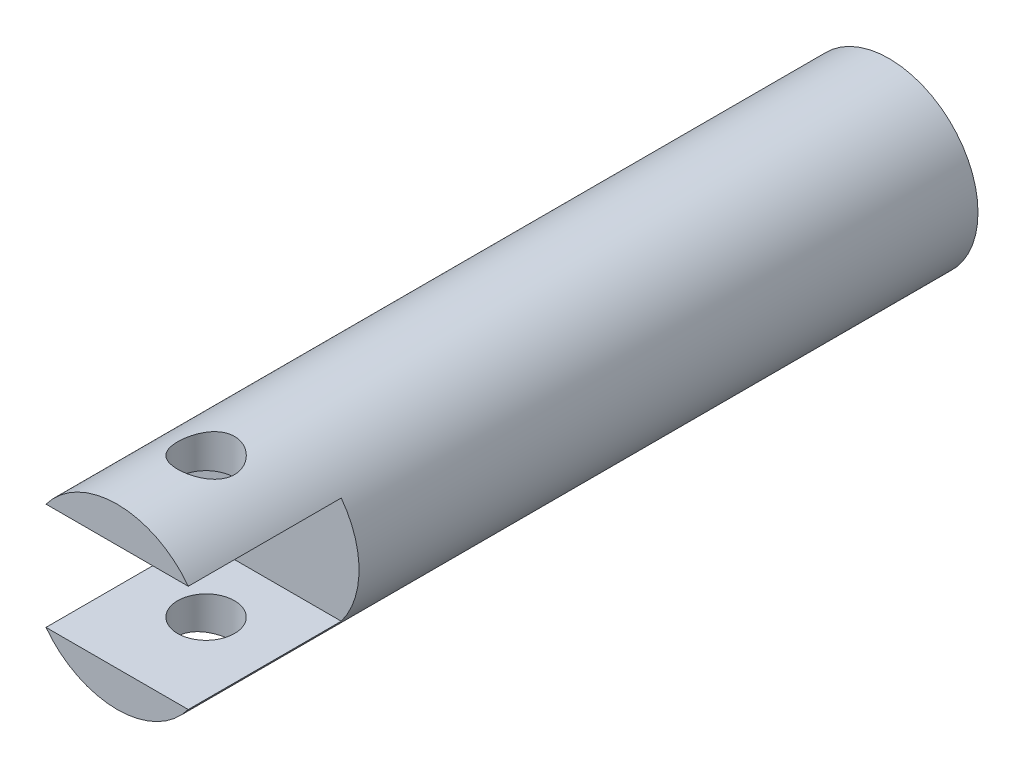
ISO-10303-21;
HEADER;
FILE_DESCRIPTION(('STEP AP214'),'2;1');
FILE_NAME('part.step','',(''),(''),'','','');
FILE_SCHEMA(('AUTOMOTIVE_DESIGN { 1 0 10303 214 1 1 1 1 }'));
ENDSEC;
DATA;
#1=APPLICATION_CONTEXT('core data for automotive mechanical design processes');
#2=APPLICATION_PROTOCOL_DEFINITION('international standard','automotive_design',2000,#1);
#3=PRODUCT_CONTEXT('',#1,'mechanical');
#4=PRODUCT('Part','Part','',(#3));
#5=PRODUCT_RELATED_PRODUCT_CATEGORY('part','',(#4));
#6=PRODUCT_DEFINITION_FORMATION('','',#4);
#7=PRODUCT_DEFINITION_CONTEXT('part definition',#1,'design');
#8=PRODUCT_DEFINITION('design','',#6,#7);
#9=PRODUCT_DEFINITION_SHAPE('','',#8);
#10=(LENGTH_UNIT() NAMED_UNIT(*) SI_UNIT(.MILLI.,.METRE.));
#11=(NAMED_UNIT(*) PLANE_ANGLE_UNIT() SI_UNIT($,.RADIAN.));
#12=(NAMED_UNIT(*) SI_UNIT($,.STERADIAN.) SOLID_ANGLE_UNIT());
#13=UNCERTAINTY_MEASURE_WITH_UNIT(LENGTH_MEASURE(1.E-05),#10,'distance_accuracy_value','');
#14=(GEOMETRIC_REPRESENTATION_CONTEXT(3) GLOBAL_UNCERTAINTY_ASSIGNED_CONTEXT((#13)) GLOBAL_UNIT_ASSIGNED_CONTEXT((#10,
#11,#12)) REPRESENTATION_CONTEXT('',''));
#15=CARTESIAN_POINT('',(0.,0.,0.));
#16=DIRECTION('',(0.,0.,1.));
#17=DIRECTION('',(1.,0.,0.));
#18=AXIS2_PLACEMENT_3D('',#15,#16,#17);
#19=CARTESIAN_POINT('',(0.,0.,217.));
#20=DIRECTION('',(0.,0.,1.));
#21=DIRECTION('',(1.,0.,0.));
#22=AXIS2_PLACEMENT_3D('',#19,#20,#21);
#23=PLANE('',#22);
#24=DIRECTION('',(-1.,0.,0.));
#25=VECTOR('',#24,1.);
#26=CARTESIAN_POINT('',(0.,15.,217.));
#27=LINE('',#26,#25);
#28=CARTESIAN_POINT('',(20.,15.,217.));
#29=VERTEX_POINT('',#28);
#30=CARTESIAN_POINT('',(-20.,15.,217.));
#31=VERTEX_POINT('',#30);
#32=EDGE_CURVE('E126',#29,#31,#27,.T.);
#33=ORIENTED_EDGE('',*,*,#32,.F.);
#34=CARTESIAN_POINT('',(0.,0.,217.));
#35=DIRECTION('',(0.,0.,1.));
#36=DIRECTION('',(1.,0.,0.));
#37=AXIS2_PLACEMENT_3D('',#34,#35,#36);
#38=CIRCLE('',#37,25.);
#39=EDGE_CURVE('E121',#29,#31,#38,.T.);
#40=ORIENTED_EDGE('',*,*,#39,.T.);
#41=EDGE_LOOP('',(#33,#40));
#42=FACE_BOUND('',#41,.T.);
#43=ADVANCED_FACE('F43',(#42),#23,.T.);
#44=CARTESIAN_POINT('',(0.,0.,217.));
#45=DIRECTION('',(0.,0.,-1.));
#46=DIRECTION('',(-1.,0.,0.));
#47=AXIS2_PLACEMENT_3D('',#44,#45,#46);
#48=CYLINDRICAL_SURFACE('',#47,25.);
#49=CARTESIAN_POINT('',(0.,-25.,200.));
#50=CARTESIAN_POINT('',(0.218743265247565,-24.9999999061477,199.999999862811));
#51=CARTESIAN_POINT('',(0.43748888425134,-24.9971224010622,199.991021108109));
#52=CARTESIAN_POINT('',(0.87336189831748,-24.985691347525,199.955190674816));
#53=CARTESIAN_POINT('',(1.09048927039918,-24.9771377186217,199.928338742897));
#54=CARTESIAN_POINT('',(1.52153070666351,-24.9545891858396,199.857013696657));
#55=CARTESIAN_POINT('',(1.73544490489068,-24.9405945096043,199.812541319544));
#56=CARTESIAN_POINT('',(2.15863313908122,-24.9075364102002,199.706355425903));
#57=CARTESIAN_POINT('',(2.36790535620395,-24.888471036932,199.644635275727));
#58=CARTESIAN_POINT('',(2.77988031823148,-24.8458260104941,199.504632126803));
#59=CARTESIAN_POINT('',(2.98259542357033,-24.8222555090754,199.426382672481));
#60=CARTESIAN_POINT('',(3.38065275599839,-24.7711822888404,199.253844594609));
#61=CARTESIAN_POINT('',(3.57599217498418,-24.7436780910757,199.159549936016));
#62=CARTESIAN_POINT('',(3.95794908794833,-24.6854603705866,198.955680457104));
#63=CARTESIAN_POINT('',(4.14456903959479,-24.6547477601795,198.846109977539));
#64=CARTESIAN_POINT('',(4.50811504509704,-24.5908719246595,198.612383925673));
#65=CARTESIAN_POINT('',(4.68503659666326,-24.5577075778769,198.488221662117));
#66=CARTESIAN_POINT('',(5.03301408453022,-24.488796033414,198.222385309282));
#67=CARTESIAN_POINT('',(5.20375408879706,-24.4530019467294,198.080309699126));
#68=CARTESIAN_POINT('',(5.53275380725715,-24.3806687959203,197.782548227954));
#69=CARTESIAN_POINT('',(5.69101326907349,-24.3441297167497,197.626862091845));
#70=CARTESIAN_POINT('',(5.99413557676902,-24.2712721273087,197.302790073572));
#71=CARTESIAN_POINT('',(6.13899335443544,-24.2349537052978,197.134399430205));
#72=CARTESIAN_POINT('',(6.41427135840069,-24.1635539684896,196.786061499396));
#73=CARTESIAN_POINT('',(6.54469691314274,-24.1284722003959,196.606118516167));
#74=CARTESIAN_POINT('',(6.79356627376886,-24.0596046131892,196.230779688898));
#75=CARTESIAN_POINT('',(6.91159914571261,-24.0258780779972,196.03510013926));
#76=CARTESIAN_POINT('',(7.13064926390916,-23.9617792893349,195.634010605258));
#77=CARTESIAN_POINT('',(7.23167321503684,-23.9314057157688,195.428604496184));
#78=CARTESIAN_POINT('',(7.41592928430639,-23.8749509852088,195.009387506085));
#79=CARTESIAN_POINT('',(7.4991615561078,-23.8488697911438,194.795576697666));
#80=CARTESIAN_POINT('',(7.64708668337306,-23.8018507099147,194.361085427054));
#81=CARTESIAN_POINT('',(7.71178030064701,-23.7809126114101,194.140405247558));
#82=CARTESIAN_POINT('',(7.82027654696603,-23.7454507385788,193.700852631298));
#83=CARTESIAN_POINT('',(7.8646711461595,-23.7307462657405,193.482140854624));
#84=CARTESIAN_POINT('',(7.93505826774671,-23.7073033405608,193.04145785506));
#85=CARTESIAN_POINT('',(7.96105114480748,-23.6985647732351,192.819486695075));
#86=CARTESIAN_POINT('',(7.99437065635129,-23.6873457397689,192.374043844835));
#87=CARTESIAN_POINT('',(8.00170182918087,-23.6848637520901,192.15057253266));
#88=CARTESIAN_POINT('',(7.99763563591977,-23.6862371500807,191.703822941352));
#89=CARTESIAN_POINT('',(7.98623874529432,-23.690092374862,191.480544657463));
#90=CARTESIAN_POINT('',(7.94570429414829,-23.703717269299,191.045251107606));
#91=CARTESIAN_POINT('',(7.91733072305876,-23.7132321396269,190.833156168725));
#92=CARTESIAN_POINT('',(7.84374939322094,-23.7376725259022,190.412147192187));
#93=CARTESIAN_POINT('',(7.79853566669937,-23.7525999598911,190.20323430953));
#94=CARTESIAN_POINT('',(7.69168696924465,-23.7874147928651,189.790145831872));
#95=CARTESIAN_POINT('',(7.63005683359995,-23.8073007312625,189.585968861174));
#96=CARTESIAN_POINT('',(7.49085223656067,-23.8514666562278,189.183533179719));
#97=CARTESIAN_POINT('',(7.41327173347221,-23.8757483073899,188.985276744232));
#98=CARTESIAN_POINT('',(7.24151771277466,-23.9284057786095,188.593106936181));
#99=CARTESIAN_POINT('',(7.14711609407101,-23.9568367598391,188.39930092285));
#100=CARTESIAN_POINT('',(6.94318205382553,-24.016734069374,188.020230878507));
#101=CARTESIAN_POINT('',(6.83364445495079,-24.0482014351731,187.834969799373));
#102=CARTESIAN_POINT('',(6.60020078291722,-24.1133164203647,187.474126788125));
#103=CARTESIAN_POINT('',(6.47629393858844,-24.1469641567308,187.298545376245));
#104=CARTESIAN_POINT('',(6.21490027829254,-24.2155584134681,186.958067669023));
#105=CARTESIAN_POINT('',(6.07741302148026,-24.2505049759786,186.793171720838));
#106=CARTESIAN_POINT('',(5.78275806425719,-24.3224956711356,186.467347476148));
#107=CARTESIAN_POINT('',(5.62496187025065,-24.3595598527758,186.306991393903));
#108=CARTESIAN_POINT('',(5.29641148883156,-24.433099471755,186.000121710398));
#109=CARTESIAN_POINT('',(5.12566144275532,-24.4695750927716,185.853603718461));
#110=CARTESIAN_POINT('',(4.77213983863551,-24.5409699950185,185.575257518353));
#111=CARTESIAN_POINT('',(4.58936277455008,-24.575888550969,185.443436113827));
#112=CARTESIAN_POINT('',(4.21308321485073,-24.6431823932812,185.195540549152));
#113=CARTESIAN_POINT('',(4.01958499097012,-24.6755586803299,185.079460179809));
#114=CARTESIAN_POINT('',(3.62126665237256,-24.7371662926383,184.86289456203));
#115=CARTESIAN_POINT('',(3.41636056460431,-24.7663668098111,184.762558507381));
#116=CARTESIAN_POINT('',(2.99832036669395,-24.8204446279348,184.579615304564));
#117=CARTESIAN_POINT('',(2.7851894593964,-24.8453235913977,184.497001335781));
#118=CARTESIAN_POINT('',(2.35217103924883,-24.8900514164328,184.35019274876));
#119=CARTESIAN_POINT('',(2.13228393720663,-24.9099005831638,184.285997013054));
#120=CARTESIAN_POINT('',(1.68740364417465,-24.9439857927418,184.176629116786));
#121=CARTESIAN_POINT('',(1.46241066837477,-24.9582220716843,184.131456156063));
#122=CARTESIAN_POINT('',(1.0182286451773,-24.9802051338952,184.062009945985));
#123=CARTESIAN_POINT('',(0.799171422951561,-24.9881904590846,184.036967363048));
#124=CARTESIAN_POINT('',(0.359605520473407,-24.998380097374,184.005049180525));
#125=CARTESIAN_POINT('',(0.139096881477423,-25.0005845740889,183.998173066775));
#126=CARTESIAN_POINT('',(-0.301684388611459,-24.9991510782414,184.002653038831));
#127=CARTESIAN_POINT('',(-0.521957047982127,-24.99551390883,184.014006618289));
#128=CARTESIAN_POINT('',(-0.960643471861166,-24.9825002143682,184.054832228217));
#129=CARTESIAN_POINT('',(-1.17905725268574,-24.9731237397469,184.084304099489));
#130=CARTESIAN_POINT('',(-1.60666085758015,-24.9492140183119,184.160068066689));
#131=CARTESIAN_POINT('',(-1.81594168521826,-24.934824131048,184.205893338395));
#132=CARTESIAN_POINT('',(-2.22986305734507,-24.9012216991691,184.31407229503));
#133=CARTESIAN_POINT('',(-2.4345020278266,-24.8820075445802,184.37643149812));
#134=CARTESIAN_POINT('',(-2.83767351616123,-24.8392571724058,184.517140564167));
#135=CARTESIAN_POINT('',(-3.03620765701015,-24.8157221153545,184.595486134036));
#136=CARTESIAN_POINT('',(-3.4260590530831,-24.7649102825711,184.767604732679));
#137=CARTESIAN_POINT('',(-3.61737354934722,-24.737632094513,184.861383587283));
#138=CARTESIAN_POINT('',(-3.99619379672531,-24.6793044180003,185.06617455213));
#139=CARTESIAN_POINT('',(-4.18348835944252,-24.6481783487328,185.177555483783));
#140=CARTESIAN_POINT('',(-4.54814586170992,-24.5835041721626,185.415037465053));
#141=CARTESIAN_POINT('',(-4.72550534170239,-24.5499552303715,185.541143595653));
#142=CARTESIAN_POINT('',(-5.06919619917251,-24.4812982895492,185.80722323996));
#143=CARTESIAN_POINT('',(-5.23552671030185,-24.446190168402,185.947197840915));
#144=CARTESIAN_POINT('',(-5.55617802638372,-24.3753123574237,186.240134853335));
#145=CARTESIAN_POINT('',(-5.71049855184838,-24.3395426522205,186.393097566878));
#146=CARTESIAN_POINT('',(-6.01242126512027,-24.266765496975,186.71776869709));
#147=CARTESIAN_POINT('',(-6.15947074535409,-24.2297690083856,186.889994101045));
#148=CARTESIAN_POINT('',(-6.43851923775675,-24.1571160782401,187.246403697399));
#149=CARTESIAN_POINT('',(-6.570523270124,-24.1214591923783,187.43058386848));
#150=CARTESIAN_POINT('',(-6.81866458072102,-24.0524927808986,187.809869984534));
#151=CARTESIAN_POINT('',(-6.93479547633882,-24.0191842021299,188.004980280327));
#152=CARTESIAN_POINT('',(-7.15020596800438,-23.9559420021258,188.404714434404));
#153=CARTESIAN_POINT('',(-7.24949254862722,-23.9260069837647,188.609334304437));
#154=CARTESIAN_POINT('',(-7.43020088832158,-23.870505447889,189.026186059536));
#155=CARTESIAN_POINT('',(-7.51167310646886,-23.8449266381716,189.23839441022));
#156=CARTESIAN_POINT('',(-7.65636529827826,-23.7988621590757,189.669394776871));
#157=CARTESIAN_POINT('',(-7.71959257425074,-23.7783744525038,189.888184120054));
#158=CARTESIAN_POINT('',(-7.82723033979725,-23.7431606371553,190.330771410414));
#159=CARTESIAN_POINT('',(-7.87164342134527,-23.7284337347517,190.554568663192));
#160=CARTESIAN_POINT('',(-7.94121566442474,-23.7052408808499,191.005454383198));
#161=CARTESIAN_POINT('',(-7.96637569553841,-23.6967746465831,191.232542701309));
#162=CARTESIAN_POINT('',(-7.99645049180489,-23.6866420864421,191.677366942456));
#163=CARTESIAN_POINT('',(-8.00226930238732,-23.6846721480483,191.895035308855));
#164=CARTESIAN_POINT('',(-7.99614679514984,-23.6867399313,192.330092144339));
#165=CARTESIAN_POINT('',(-7.98420580907816,-23.6907775407262,192.547480618577));
#166=CARTESIAN_POINT('',(-7.94268054634167,-23.7047316455029,192.980358057932));
#167=CARTESIAN_POINT('',(-7.91309736864516,-23.7146477746682,193.195847140517));
#168=CARTESIAN_POINT('',(-7.83656732967567,-23.7400470604446,193.623383586202));
#169=CARTESIAN_POINT('',(-7.78962040030635,-23.7555302388885,193.8354309358));
#170=CARTESIAN_POINT('',(-7.67969358667198,-23.7912922196723,194.251173669937));
#171=CARTESIAN_POINT('',(-7.6169882699802,-23.8114885111398,194.454948914285));
#172=CARTESIAN_POINT('',(-7.47567925141455,-23.8562299898703,194.856490353429));
#173=CARTESIAN_POINT('',(-7.39707024932656,-23.8807766266318,195.054254519576));
#174=CARTESIAN_POINT('',(-7.22458410698328,-23.933522740927,195.442454176872));
#175=CARTESIAN_POINT('',(-7.13070967680561,-23.961721569905,195.632890961447));
#176=CARTESIAN_POINT('',(-6.92831365997187,-24.0210238998718,196.005424482674));
#177=CARTESIAN_POINT('',(-6.81978682069163,-24.0521284412685,196.187518196986));
#178=CARTESIAN_POINT('',(-6.5841334208022,-24.1177267113063,196.549471891376));
#179=CARTESIAN_POINT('',(-6.45643079187723,-24.1523067527788,196.728941354494));
#180=CARTESIAN_POINT('',(-6.18680926743206,-24.2227744441253,197.076591818307));
#181=CARTESIAN_POINT('',(-6.0448899286005,-24.2586621347526,197.244772466717));
#182=CARTESIAN_POINT('',(-5.74766448038851,-24.3307982502988,197.568906857108));
#183=CARTESIAN_POINT('',(-5.59235279583197,-24.3670468198413,197.724855454846));
#184=CARTESIAN_POINT('',(-5.26938993453569,-24.4389215125895,198.023444203562));
#185=CARTESIAN_POINT('',(-5.10174285792802,-24.4745478377931,198.166088741217));
#186=CARTESIAN_POINT('',(-4.74894112096544,-24.5454895286252,198.442007274254));
#187=CARTESIAN_POINT('',(-4.56337747943052,-24.5807495900706,198.574773197678));
#188=CARTESIAN_POINT('',(-4.18131157536835,-24.6486157658354,198.824122777065));
#189=CARTESIAN_POINT('',(-3.98481320350348,-24.6812228140783,198.940712137845));
#190=CARTESIAN_POINT('',(-3.58214010374017,-24.7428727035054,199.15684856076));
#191=CARTESIAN_POINT('',(-3.37596625600627,-24.7719158680257,199.256397169255));
#192=CARTESIAN_POINT('',(-2.95536223754053,-24.8256070490431,199.437624727694));
#193=CARTESIAN_POINT('',(-2.74093265081571,-24.8502553757369,199.519304938918));
#194=CARTESIAN_POINT('',(-2.32073755029346,-24.8928821566616,199.658960960613));
#195=CARTESIAN_POINT('',(-2.11542697677707,-24.9112083268921,199.718201953922));
#196=CARTESIAN_POINT('',(-1.70037248611578,-24.942975795015,199.820127250336));
#197=CARTESIAN_POINT('',(-1.49062887681958,-24.9564174309383,199.862812699171));
#198=CARTESIAN_POINT('',(-1.06816763558635,-24.9780652480482,199.931254554404));
#199=CARTESIAN_POINT('',(-0.855450551847945,-24.9862723816063,199.957014040358));
#200=CARTESIAN_POINT('',(-0.428489757171346,-24.9972398727651,199.991387048243));
#201=CARTESIAN_POINT('',(-0.214246007569128,-25.0000000919227,200.000000134369));
#202=CARTESIAN_POINT('',(0.,-25.,200.));
#203=B_SPLINE_CURVE_WITH_KNOTS('',3,(#49,#50,#51,#52,#53,#54,#55,#56,#57,#58,#59,#60,#61,#62,
#63,#64,#65,#66,#67,#68,#69,#70,#71,#72,#73,#74,#75,#76,#77,#78,#79,#80,#81,#82,#83,#84,#85,#86,
#87,#88,#89,#90,#91,#92,#93,#94,#95,#96,#97,#98,#99,#100,#101,#102,#103,#104,#105,#106,#107,
#108,#109,#110,#111,#112,#113,#114,#115,#116,#117,#118,#119,#120,#121,#122,#123,#124,#125,#126,
#127,#128,#129,#130,#131,#132,#133,#134,#135,#136,#137,#138,#139,#140,#141,#142,#143,#144,#145,
#146,#147,#148,#149,#150,#151,#152,#153,#154,#155,#156,#157,#158,#159,#160,#161,#162,#163,#164,
#165,#166,#167,#168,#169,#170,#171,#172,#173,#174,#175,#176,#177,#178,#179,#180,#181,#182,#183,
#184,#185,#186,#187,#188,#189,#190,#191,#192,#193,#194,#195,#196,#197,#198,#199,#200,#201,#202),
.UNSPECIFIED.,.T.,.F.,(4,2,2,2,2,2,2,2,2,2,2,2,2,2,2,2,2,2,2,2,2,2,2,2,2,2,2,2,2,2,2,2,2,2,2,2,
2,2,2,2,2,2,2,2,2,2,2,2,2,2,2,2,2,2,2,2,2,2,2,2,2,2,2,2,2,2,2,2,2,2,2,2,2,2,2,2,4),(0.,
0.656031665610723,1.3120726298196,1.96808614941623,2.62435232579349,3.27929926101466,
3.93449308656876,4.58950111124318,5.24481067914069,5.91900362945157,6.59321020954772,
7.26767072585324,7.9418813914792,8.63402376289964,9.32589265142225,10.0177555643119,
10.7095900423568,11.3797100261309,12.0498170939437,12.7197611826031,13.3896882630868,
14.0315222200871,14.673583845389,15.3154565665988,15.9575728663221,16.6091708298972,
17.2609922298908,17.9128486280966,18.5647261937175,19.2479546420813,19.9309655759316,
20.6142914015881,21.2973468942376,21.9865280662665,22.6754435186197,23.3643171643094,
24.0531618307572,24.7142284876896,25.375276434299,26.0362335031196,26.6971847644316,
27.3406067356917,27.9842437183902,28.6277080813896,29.2714159018675,29.9310423920676,
30.5908971650853,31.2508037098049,31.9107256068116,32.5983077197442,33.2856597320606,
33.9732873216336,34.6606290825568,35.3459979798137,36.0310921850403,36.7160919762155,
37.4010608269017,38.0535257793628,38.7059785441072,39.3583906704754,40.0108053554696,
40.6525575617292,41.2945239978234,41.9363765895295,42.5784598877874,43.2465993670095,
43.9147596869244,44.5831995145326,45.2514181560312,45.9432092356098,46.6347557250828,
47.3262394270222,48.0176743032877,48.660363380784,49.303007972936,49.9455356082041,
50.5880795742409),.UNSPECIFIED.);
#204=CARTESIAN_POINT('',(0.,-25.,200.));
#205=VERTEX_POINT('',#204);
#206=EDGE_CURVE('E93',#205,#205,#203,.T.);
#207=ORIENTED_EDGE('',*,*,#206,.T.);
#208=EDGE_LOOP('',(#207));
#209=FACE_BOUND('',#208,.T.);
#210=CARTESIAN_POINT('',(0.,25.,200.));
#211=CARTESIAN_POINT('',(-0.218743265247565,24.9999999061477,199.999999862811));
#212=CARTESIAN_POINT('',(-0.43748888425134,24.9971224010622,199.991021108109));
#213=CARTESIAN_POINT('',(-0.87336189831748,24.985691347525,199.955190674816));
#214=CARTESIAN_POINT('',(-1.09048927039918,24.9771377186217,199.928338742897));
#215=CARTESIAN_POINT('',(-1.52153070666351,24.9545891858396,199.857013696657));
#216=CARTESIAN_POINT('',(-1.73544490489068,24.9405945096043,199.812541319544));
#217=CARTESIAN_POINT('',(-2.15863313908122,24.9075364102002,199.706355425903));
#218=CARTESIAN_POINT('',(-2.36790535620395,24.888471036932,199.644635275727));
#219=CARTESIAN_POINT('',(-2.77988031823148,24.8458260104941,199.504632126803));
#220=CARTESIAN_POINT('',(-2.98259542357033,24.8222555090754,199.426382672481));
#221=CARTESIAN_POINT('',(-3.38065275599839,24.7711822888404,199.253844594609));
#222=CARTESIAN_POINT('',(-3.57599217498418,24.7436780910757,199.159549936016));
#223=CARTESIAN_POINT('',(-3.95794908794833,24.6854603705866,198.955680457104));
#224=CARTESIAN_POINT('',(-4.14456903959479,24.6547477601795,198.846109977539));
#225=CARTESIAN_POINT('',(-4.50811504509704,24.5908719246595,198.612383925673));
#226=CARTESIAN_POINT('',(-4.68503659666326,24.5577075778769,198.488221662117));
#227=CARTESIAN_POINT('',(-5.03301408453022,24.488796033414,198.222385309282));
#228=CARTESIAN_POINT('',(-5.20375408879706,24.4530019467294,198.080309699126));
#229=CARTESIAN_POINT('',(-5.53275380725715,24.3806687959203,197.782548227954));
#230=CARTESIAN_POINT('',(-5.69101326907349,24.3441297167497,197.626862091845));
#231=CARTESIAN_POINT('',(-5.99413557676902,24.2712721273087,197.302790073572));
#232=CARTESIAN_POINT('',(-6.13899335443544,24.2349537052978,197.134399430205));
#233=CARTESIAN_POINT('',(-6.41427135840069,24.1635539684896,196.786061499396));
#234=CARTESIAN_POINT('',(-6.54469691314274,24.1284722003959,196.606118516167));
#235=CARTESIAN_POINT('',(-6.79356627376886,24.0596046131892,196.230779688898));
#236=CARTESIAN_POINT('',(-6.91159914571261,24.0258780779972,196.03510013926));
#237=CARTESIAN_POINT('',(-7.13064926390916,23.9617792893349,195.634010605258));
#238=CARTESIAN_POINT('',(-7.23167321503684,23.9314057157688,195.428604496184));
#239=CARTESIAN_POINT('',(-7.41592928430639,23.8749509852088,195.009387506085));
#240=CARTESIAN_POINT('',(-7.4991615561078,23.8488697911438,194.795576697666));
#241=CARTESIAN_POINT('',(-7.64708668337306,23.8018507099147,194.361085427054));
#242=CARTESIAN_POINT('',(-7.71178030064701,23.7809126114101,194.140405247558));
#243=CARTESIAN_POINT('',(-7.82027654696603,23.7454507385788,193.700852631298));
#244=CARTESIAN_POINT('',(-7.8646711461595,23.7307462657405,193.482140854624));
#245=CARTESIAN_POINT('',(-7.93505826774671,23.7073033405608,193.04145785506));
#246=CARTESIAN_POINT('',(-7.96105114480748,23.6985647732351,192.819486695075));
#247=CARTESIAN_POINT('',(-7.99437065635129,23.6873457397689,192.374043844835));
#248=CARTESIAN_POINT('',(-8.00170182918087,23.6848637520901,192.15057253266));
#249=CARTESIAN_POINT('',(-7.99763563591977,23.6862371500807,191.703822941352));
#250=CARTESIAN_POINT('',(-7.98623874529432,23.690092374862,191.480544657463));
#251=CARTESIAN_POINT('',(-7.94570429414829,23.703717269299,191.045251107606));
#252=CARTESIAN_POINT('',(-7.91733072305876,23.7132321396269,190.833156168725));
#253=CARTESIAN_POINT('',(-7.84374939322094,23.7376725259022,190.412147192187));
#254=CARTESIAN_POINT('',(-7.79853566669937,23.7525999598911,190.20323430953));
#255=CARTESIAN_POINT('',(-7.69168696924465,23.7874147928651,189.790145831872));
#256=CARTESIAN_POINT('',(-7.63005683359995,23.8073007312625,189.585968861174));
#257=CARTESIAN_POINT('',(-7.49085223656067,23.8514666562278,189.183533179719));
#258=CARTESIAN_POINT('',(-7.41327173347221,23.8757483073899,188.985276744232));
#259=CARTESIAN_POINT('',(-7.24151771277466,23.9284057786095,188.593106936181));
#260=CARTESIAN_POINT('',(-7.14711609407101,23.9568367598391,188.39930092285));
#261=CARTESIAN_POINT('',(-6.94318205382553,24.016734069374,188.020230878507));
#262=CARTESIAN_POINT('',(-6.83364445495079,24.0482014351731,187.834969799373));
#263=CARTESIAN_POINT('',(-6.60020078291722,24.1133164203647,187.474126788125));
#264=CARTESIAN_POINT('',(-6.47629393858844,24.1469641567308,187.298545376245));
#265=CARTESIAN_POINT('',(-6.21490027829254,24.2155584134681,186.958067669023));
#266=CARTESIAN_POINT('',(-6.07741302148026,24.2505049759786,186.793171720838));
#267=CARTESIAN_POINT('',(-5.78275806425719,24.3224956711356,186.467347476148));
#268=CARTESIAN_POINT('',(-5.62496187025065,24.3595598527758,186.306991393903));
#269=CARTESIAN_POINT('',(-5.29641148883156,24.433099471755,186.000121710398));
#270=CARTESIAN_POINT('',(-5.12566144275532,24.4695750927716,185.853603718461));
#271=CARTESIAN_POINT('',(-4.77213983863551,24.5409699950185,185.575257518353));
#272=CARTESIAN_POINT('',(-4.58936277455008,24.575888550969,185.443436113827));
#273=CARTESIAN_POINT('',(-4.21308321485073,24.6431823932812,185.195540549152));
#274=CARTESIAN_POINT('',(-4.01958499097012,24.6755586803299,185.079460179809));
#275=CARTESIAN_POINT('',(-3.62126665237256,24.7371662926383,184.86289456203));
#276=CARTESIAN_POINT('',(-3.41636056460431,24.7663668098111,184.762558507381));
#277=CARTESIAN_POINT('',(-2.99832036669395,24.8204446279348,184.579615304564));
#278=CARTESIAN_POINT('',(-2.7851894593964,24.8453235913977,184.497001335781));
#279=CARTESIAN_POINT('',(-2.35217103924883,24.8900514164328,184.35019274876));
#280=CARTESIAN_POINT('',(-2.13228393720663,24.9099005831638,184.285997013054));
#281=CARTESIAN_POINT('',(-1.68740364417465,24.9439857927418,184.176629116786));
#282=CARTESIAN_POINT('',(-1.46241066837477,24.9582220716843,184.131456156063));
#283=CARTESIAN_POINT('',(-1.0182286451773,24.9802051338952,184.062009945985));
#284=CARTESIAN_POINT('',(-0.799171422951561,24.9881904590846,184.036967363048));
#285=CARTESIAN_POINT('',(-0.359605520473407,24.998380097374,184.005049180525));
#286=CARTESIAN_POINT('',(-0.139096881477423,25.0005845740889,183.998173066775));
#287=CARTESIAN_POINT('',(0.301684388611459,24.9991510782414,184.002653038831));
#288=CARTESIAN_POINT('',(0.521957047982127,24.99551390883,184.014006618289));
#289=CARTESIAN_POINT('',(0.960643471861166,24.9825002143682,184.054832228217));
#290=CARTESIAN_POINT('',(1.17905725268574,24.9731237397469,184.084304099489));
#291=CARTESIAN_POINT('',(1.60666085758015,24.9492140183119,184.160068066689));
#292=CARTESIAN_POINT('',(1.81594168521826,24.934824131048,184.205893338395));
#293=CARTESIAN_POINT('',(2.22986305734507,24.9012216991691,184.31407229503));
#294=CARTESIAN_POINT('',(2.4345020278266,24.8820075445802,184.37643149812));
#295=CARTESIAN_POINT('',(2.83767351616123,24.8392571724058,184.517140564167));
#296=CARTESIAN_POINT('',(3.03620765701015,24.8157221153545,184.595486134036));
#297=CARTESIAN_POINT('',(3.4260590530831,24.7649102825711,184.767604732679));
#298=CARTESIAN_POINT('',(3.61737354934722,24.737632094513,184.861383587283));
#299=CARTESIAN_POINT('',(3.99619379672531,24.6793044180003,185.06617455213));
#300=CARTESIAN_POINT('',(4.18348835944252,24.6481783487328,185.177555483783));
#301=CARTESIAN_POINT('',(4.54814586170992,24.5835041721626,185.415037465053));
#302=CARTESIAN_POINT('',(4.72550534170239,24.5499552303715,185.541143595653));
#303=CARTESIAN_POINT('',(5.06919619917251,24.4812982895492,185.80722323996));
#304=CARTESIAN_POINT('',(5.23552671030185,24.446190168402,185.947197840915));
#305=CARTESIAN_POINT('',(5.55617802638372,24.3753123574237,186.240134853335));
#306=CARTESIAN_POINT('',(5.71049855184838,24.3395426522205,186.393097566878));
#307=CARTESIAN_POINT('',(6.01242126512027,24.266765496975,186.71776869709));
#308=CARTESIAN_POINT('',(6.15947074535409,24.2297690083856,186.889994101045));
#309=CARTESIAN_POINT('',(6.43851923775675,24.1571160782401,187.246403697399));
#310=CARTESIAN_POINT('',(6.570523270124,24.1214591923783,187.43058386848));
#311=CARTESIAN_POINT('',(6.81866458072102,24.0524927808986,187.809869984534));
#312=CARTESIAN_POINT('',(6.93479547633882,24.0191842021299,188.004980280327));
#313=CARTESIAN_POINT('',(7.15020596800438,23.9559420021258,188.404714434404));
#314=CARTESIAN_POINT('',(7.24949254862722,23.9260069837647,188.609334304437));
#315=CARTESIAN_POINT('',(7.43020088832158,23.870505447889,189.026186059536));
#316=CARTESIAN_POINT('',(7.51167310646886,23.8449266381716,189.23839441022));
#317=CARTESIAN_POINT('',(7.65636529827826,23.7988621590757,189.669394776871));
#318=CARTESIAN_POINT('',(7.71959257425074,23.7783744525038,189.888184120054));
#319=CARTESIAN_POINT('',(7.82723033979725,23.7431606371553,190.330771410414));
#320=CARTESIAN_POINT('',(7.87164342134527,23.7284337347517,190.554568663192));
#321=CARTESIAN_POINT('',(7.94121566442474,23.7052408808499,191.005454383198));
#322=CARTESIAN_POINT('',(7.96637569553841,23.6967746465831,191.232542701309));
#323=CARTESIAN_POINT('',(7.99645049180489,23.6866420864421,191.677366942456));
#324=CARTESIAN_POINT('',(8.00226930238732,23.6846721480483,191.895035308855));
#325=CARTESIAN_POINT('',(7.99614679514984,23.6867399313,192.330092144339));
#326=CARTESIAN_POINT('',(7.98420580907816,23.6907775407262,192.547480618577));
#327=CARTESIAN_POINT('',(7.94268054634167,23.7047316455029,192.980358057932));
#328=CARTESIAN_POINT('',(7.91309736864516,23.7146477746682,193.195847140517));
#329=CARTESIAN_POINT('',(7.83656732967567,23.7400470604446,193.623383586202));
#330=CARTESIAN_POINT('',(7.78962040030635,23.7555302388885,193.8354309358));
#331=CARTESIAN_POINT('',(7.67969358667198,23.7912922196723,194.251173669937));
#332=CARTESIAN_POINT('',(7.6169882699802,23.8114885111398,194.454948914285));
#333=CARTESIAN_POINT('',(7.47567925141455,23.8562299898703,194.856490353429));
#334=CARTESIAN_POINT('',(7.39707024932656,23.8807766266318,195.054254519576));
#335=CARTESIAN_POINT('',(7.22458410698328,23.933522740927,195.442454176872));
#336=CARTESIAN_POINT('',(7.13070967680561,23.961721569905,195.632890961447));
#337=CARTESIAN_POINT('',(6.92831365997187,24.0210238998718,196.005424482674));
#338=CARTESIAN_POINT('',(6.81978682069163,24.0521284412685,196.187518196986));
#339=CARTESIAN_POINT('',(6.5841334208022,24.1177267113063,196.549471891376));
#340=CARTESIAN_POINT('',(6.45643079187723,24.1523067527788,196.728941354494));
#341=CARTESIAN_POINT('',(6.18680926743206,24.2227744441253,197.076591818307));
#342=CARTESIAN_POINT('',(6.0448899286005,24.2586621347526,197.244772466717));
#343=CARTESIAN_POINT('',(5.74766448038851,24.3307982502988,197.568906857108));
#344=CARTESIAN_POINT('',(5.59235279583197,24.3670468198413,197.724855454846));
#345=CARTESIAN_POINT('',(5.26938993453569,24.4389215125895,198.023444203562));
#346=CARTESIAN_POINT('',(5.10174285792802,24.4745478377931,198.166088741217));
#347=CARTESIAN_POINT('',(4.74894112096544,24.5454895286252,198.442007274254));
#348=CARTESIAN_POINT('',(4.56337747943052,24.5807495900706,198.574773197678));
#349=CARTESIAN_POINT('',(4.18131157536835,24.6486157658354,198.824122777065));
#350=CARTESIAN_POINT('',(3.98481320350348,24.6812228140783,198.940712137845));
#351=CARTESIAN_POINT('',(3.58214010374017,24.7428727035054,199.15684856076));
#352=CARTESIAN_POINT('',(3.37596625600627,24.7719158680257,199.256397169255));
#353=CARTESIAN_POINT('',(2.95536223754053,24.8256070490431,199.437624727694));
#354=CARTESIAN_POINT('',(2.74093265081571,24.8502553757369,199.519304938918));
#355=CARTESIAN_POINT('',(2.32073755029346,24.8928821566616,199.658960960613));
#356=CARTESIAN_POINT('',(2.11542697677707,24.9112083268921,199.718201953922));
#357=CARTESIAN_POINT('',(1.70037248611578,24.942975795015,199.820127250336));
#358=CARTESIAN_POINT('',(1.49062887681958,24.9564174309383,199.862812699171));
#359=CARTESIAN_POINT('',(1.06816763558635,24.9780652480482,199.931254554404));
#360=CARTESIAN_POINT('',(0.855450551847945,24.9862723816063,199.957014040358));
#361=CARTESIAN_POINT('',(0.428489757171346,24.9972398727651,199.991387048243));
#362=CARTESIAN_POINT('',(0.214246007569128,25.0000000919227,200.000000134369));
#363=CARTESIAN_POINT('',(0.,25.,200.));
#364=B_SPLINE_CURVE_WITH_KNOTS('',3,(#210,#211,#212,#213,#214,#215,#216,#217,#218,#219,#220,
#221,#222,#223,#224,#225,#226,#227,#228,#229,#230,#231,#232,#233,#234,#235,#236,#237,#238,#239,
#240,#241,#242,#243,#244,#245,#246,#247,#248,#249,#250,#251,#252,#253,#254,#255,#256,#257,#258,
#259,#260,#261,#262,#263,#264,#265,#266,#267,#268,#269,#270,#271,#272,#273,#274,#275,#276,#277,
#278,#279,#280,#281,#282,#283,#284,#285,#286,#287,#288,#289,#290,#291,#292,#293,#294,#295,#296,
#297,#298,#299,#300,#301,#302,#303,#304,#305,#306,#307,#308,#309,#310,#311,#312,#313,#314,#315,
#316,#317,#318,#319,#320,#321,#322,#323,#324,#325,#326,#327,#328,#329,#330,#331,#332,#333,#334,
#335,#336,#337,#338,#339,#340,#341,#342,#343,#344,#345,#346,#347,#348,#349,#350,#351,#352,#353,
#354,#355,#356,#357,#358,#359,#360,#361,#362,#363),.UNSPECIFIED.,.T.,.F.,(4,2,2,2,2,2,2,2,2,2,2,
2,2,2,2,2,2,2,2,2,2,2,2,2,2,2,2,2,2,2,2,2,2,2,2,2,2,2,2,2,2,2,2,2,2,2,2,2,2,2,2,2,2,2,2,2,2,2,2,
2,2,2,2,2,2,2,2,2,2,2,2,2,2,2,2,2,4),(0.,0.656031665610723,1.3120726298196,1.96808614941623,
2.62435232579349,3.27929926101466,3.93449308656876,4.58950111124318,5.24481067914069,
5.91900362945157,6.59321020954772,7.26767072585324,7.9418813914792,8.63402376289964,
9.32589265142225,10.0177555643119,10.7095900423568,11.3797100261309,12.0498170939437,
12.7197611826031,13.3896882630868,14.0315222200871,14.673583845389,15.3154565665988,
15.9575728663221,16.6091708298972,17.2609922298908,17.9128486280966,18.5647261937175,
19.2479546420813,19.9309655759316,20.6142914015881,21.2973468942376,21.9865280662665,
22.6754435186197,23.3643171643094,24.0531618307572,24.7142284876896,25.375276434299,
26.0362335031196,26.6971847644316,27.3406067356917,27.9842437183902,28.6277080813896,
29.2714159018675,29.9310423920676,30.5908971650853,31.2508037098049,31.9107256068116,
32.5983077197442,33.2856597320606,33.9732873216336,34.6606290825568,35.3459979798137,
36.0310921850403,36.7160919762155,37.4010608269017,38.0535257793628,38.7059785441072,
39.3583906704754,40.0108053554696,40.6525575617292,41.2945239978234,41.9363765895295,
42.5784598877874,43.2465993670095,43.9147596869244,44.5831995145326,45.2514181560312,
45.9432092356098,46.6347557250828,47.3262394270222,48.0176743032877,48.660363380784,
49.303007972936,49.9455356082041,50.5880795742409),.UNSPECIFIED.);
#365=CARTESIAN_POINT('',(0.,25.,200.));
#366=VERTEX_POINT('',#365);
#367=EDGE_CURVE('E188',#366,#366,#364,.T.);
#368=ORIENTED_EDGE('',*,*,#367,.T.);
#369=EDGE_LOOP('',(#368));
#370=FACE_BOUND('',#369,.T.);
#371=CARTESIAN_POINT('',(0.,0.,174.));
#372=DIRECTION('',(0.,0.,-1.));
#373=DIRECTION('',(-1.,0.,0.));
#374=AXIS2_PLACEMENT_3D('',#371,#372,#373);
#375=CIRCLE('',#374,25.);
#376=CARTESIAN_POINT('',(-20.,-15.,174.));
#377=VERTEX_POINT('',#376);
#378=CARTESIAN_POINT('',(-20.,15.,174.));
#379=VERTEX_POINT('',#378);
#380=EDGE_CURVE('E11',#377,#379,#375,.T.);
#381=ORIENTED_EDGE('',*,*,#380,.T.);
#382=DIRECTION('',(0.,0.,-1.));
#383=VECTOR('',#382,1.);
#384=CARTESIAN_POINT('',(-20.,15.,217.));
#385=LINE('',#384,#383);
#386=EDGE_CURVE('E99',#379,#31,#385,.F.);
#387=ORIENTED_EDGE('',*,*,#386,.T.);
#388=ORIENTED_EDGE('',*,*,#39,.F.);
#389=DIRECTION('',(0.,0.,-1.));
#390=VECTOR('',#389,1.);
#391=CARTESIAN_POINT('',(20.,15.,217.));
#392=LINE('',#391,#390);
#393=CARTESIAN_POINT('',(20.,15.,174.));
#394=VERTEX_POINT('',#393);
#395=EDGE_CURVE('E101',#29,#394,#392,.T.);
#396=ORIENTED_EDGE('',*,*,#395,.T.);
#397=CARTESIAN_POINT('',(20.,-15.,174.));
#398=VERTEX_POINT('',#397);
#399=EDGE_CURVE('E53',#394,#398,#375,.T.);
#400=ORIENTED_EDGE('',*,*,#399,.T.);
#401=DIRECTION('',(0.,0.,-1.));
#402=VECTOR('',#401,1.);
#403=CARTESIAN_POINT('',(20.,-15.,217.));
#404=LINE('',#403,#402);
#405=CARTESIAN_POINT('',(20.,-15.,217.));
#406=VERTEX_POINT('',#405);
#407=EDGE_CURVE('E92',#398,#406,#404,.F.);
#408=ORIENTED_EDGE('',*,*,#407,.T.);
#409=CARTESIAN_POINT('',(-20.,-15.,217.));
#410=VERTEX_POINT('',#409);
#411=EDGE_CURVE('E98',#410,#406,#38,.T.);
#412=ORIENTED_EDGE('',*,*,#411,.F.);
#413=DIRECTION('',(0.,0.,-1.));
#414=VECTOR('',#413,1.);
#415=CARTESIAN_POINT('',(-20.,-15.,217.));
#416=LINE('',#415,#414);
#417=EDGE_CURVE('E60',#410,#377,#416,.T.);
#418=ORIENTED_EDGE('',*,*,#417,.T.);
#419=EDGE_LOOP('',(#381,#387,#388,#396,#400,#408,#412,#418));
#420=FACE_BOUND('',#419,.T.);
#421=CARTESIAN_POINT('',(0.,0.,0.));
#422=DIRECTION('',(0.,0.,1.));
#423=DIRECTION('',(1.,0.,0.));
#424=AXIS2_PLACEMENT_3D('',#421,#422,#423);
#425=CIRCLE('',#424,25.);
#426=CARTESIAN_POINT('',(25.,0.,0.));
#427=VERTEX_POINT('',#426);
#428=EDGE_CURVE('E117',#427,#427,#425,.T.);
#429=ORIENTED_EDGE('',*,*,#428,.T.);
#430=EDGE_LOOP('',(#429));
#431=FACE_BOUND('',#430,.T.);
#432=ADVANCED_FACE('F45',(#209,#370,#420,#431),#48,.T.);
#433=DIRECTION('',(1.,0.,0.));
#434=VECTOR('',#433,1.);
#435=CARTESIAN_POINT('',(0.,-15.,217.));
#436=LINE('',#435,#434);
#437=EDGE_CURVE('E124',#410,#406,#436,.T.);
#438=ORIENTED_EDGE('',*,*,#437,.F.);
#439=ORIENTED_EDGE('',*,*,#411,.T.);
#440=EDGE_LOOP('',(#438,#439));
#441=FACE_BOUND('',#440,.T.);
#442=ADVANCED_FACE('F135',(#441),#23,.T.);
#443=CARTESIAN_POINT('',(0.,0.,0.));
#444=DIRECTION('',(0.,0.,1.));
#445=DIRECTION('',(1.,0.,0.));
#446=AXIS2_PLACEMENT_3D('',#443,#444,#445);
#447=PLANE('',#446);
#448=CARTESIAN_POINT('',(0.,0.,0.));
#449=DIRECTION('',(0.,0.,-1.));
#450=DIRECTION('',(-1.,0.,0.));
#451=AXIS2_PLACEMENT_3D('',#448,#449,#450);
#452=CIRCLE('',#451,19.);
#453=CARTESIAN_POINT('',(-19.,0.,0.));
#454=VERTEX_POINT('',#453);
#455=EDGE_CURVE('E111',#454,#454,#452,.T.);
#456=ORIENTED_EDGE('',*,*,#455,.F.);
#457=EDGE_LOOP('',(#456));
#458=FACE_BOUND('',#457,.T.);
#459=ORIENTED_EDGE('',*,*,#428,.F.);
#460=EDGE_LOOP('',(#459));
#461=FACE_BOUND('',#460,.T.);
#462=ADVANCED_FACE('F142',(#458,#461),#447,.F.);
#463=CARTESIAN_POINT('',(0.,0.,10.));
#464=DIRECTION('',(0.,0.,-1.));
#465=DIRECTION('',(-1.,0.,0.));
#466=AXIS2_PLACEMENT_3D('',#463,#464,#465);
#467=CYLINDRICAL_SURFACE('',#466,19.);
#468=CARTESIAN_POINT('',(0.,0.,10.));
#469=DIRECTION('',(0.,0.,-1.));
#470=DIRECTION('',(-1.,0.,0.));
#471=AXIS2_PLACEMENT_3D('',#468,#469,#470);
#472=CIRCLE('',#471,19.);
#473=CARTESIAN_POINT('',(-19.,0.,10.));
#474=VERTEX_POINT('',#473);
#475=EDGE_CURVE('E114',#474,#474,#472,.T.);
#476=ORIENTED_EDGE('',*,*,#475,.F.);
#477=EDGE_LOOP('',(#476));
#478=FACE_BOUND('',#477,.T.);
#479=ORIENTED_EDGE('',*,*,#455,.T.);
#480=EDGE_LOOP('',(#479));
#481=FACE_BOUND('',#480,.T.);
#482=ADVANCED_FACE('F147',(#478,#481),#467,.F.);
#483=CARTESIAN_POINT('',(0.,0.,10.));
#484=DIRECTION('',(0.,0.,-1.));
#485=DIRECTION('',(-1.,0.,0.));
#486=AXIS2_PLACEMENT_3D('',#483,#484,#485);
#487=PLANE('',#486);
#488=CARTESIAN_POINT('',(0.,0.,10.));
#489=DIRECTION('',(0.,0.,-1.));
#490=DIRECTION('',(-1.,0.,0.));
#491=AXIS2_PLACEMENT_3D('',#488,#489,#490);
#492=CIRCLE('',#491,14.);
#493=CARTESIAN_POINT('',(-14.,0.,10.));
#494=VERTEX_POINT('',#493);
#495=EDGE_CURVE('E107',#494,#494,#492,.T.);
#496=ORIENTED_EDGE('',*,*,#495,.F.);
#497=EDGE_LOOP('',(#496));
#498=FACE_BOUND('',#497,.T.);
#499=ORIENTED_EDGE('',*,*,#475,.T.);
#500=EDGE_LOOP('',(#499));
#501=FACE_BOUND('',#500,.T.);
#502=ADVANCED_FACE('F152',(#498,#501),#487,.T.);
#503=CARTESIAN_POINT('',(0.,0.,20.));
#504=DIRECTION('',(0.,0.,-1.));
#505=DIRECTION('',(-1.,0.,0.));
#506=AXIS2_PLACEMENT_3D('',#503,#504,#505);
#507=CYLINDRICAL_SURFACE('',#506,14.);
#508=CARTESIAN_POINT('',(0.,0.,20.));
#509=DIRECTION('',(0.,0.,-1.));
#510=DIRECTION('',(-1.,0.,0.));
#511=AXIS2_PLACEMENT_3D('',#508,#509,#510);
#512=CIRCLE('',#511,14.);
#513=CARTESIAN_POINT('',(-14.,0.,20.));
#514=VERTEX_POINT('',#513);
#515=EDGE_CURVE('E108',#514,#514,#512,.T.);
#516=ORIENTED_EDGE('',*,*,#515,.F.);
#517=EDGE_LOOP('',(#516));
#518=FACE_BOUND('',#517,.T.);
#519=ORIENTED_EDGE('',*,*,#495,.T.);
#520=EDGE_LOOP('',(#519));
#521=FACE_BOUND('',#520,.T.);
#522=ADVANCED_FACE('F161',(#518,#521),#507,.F.);
#523=CARTESIAN_POINT('',(0.,0.,20.));
#524=DIRECTION('',(0.,0.,-1.));
#525=DIRECTION('',(-1.,0.,0.));
#526=AXIS2_PLACEMENT_3D('',#523,#524,#525);
#527=PLANE('',#526);
#528=ORIENTED_EDGE('',*,*,#515,.T.);
#529=EDGE_LOOP('',(#528));
#530=FACE_BOUND('',#529,.T.);
#531=ADVANCED_FACE('F168',(#530),#527,.T.);
#532=CARTESIAN_POINT('',(-25.,15.,174.));
#533=DIRECTION('',(0.,0.,-1.));
#534=DIRECTION('',(-1.,0.,0.));
#535=AXIS2_PLACEMENT_3D('',#532,#533,#534);
#536=PLANE('',#535);
#537=DIRECTION('',(1.,0.,0.));
#538=VECTOR('',#537,1.);
#539=CARTESIAN_POINT('',(-25.,15.,174.));
#540=LINE('',#539,#538);
#541=EDGE_CURVE('E86',#379,#394,#540,.T.);
#542=ORIENTED_EDGE('',*,*,#541,.F.);
#543=ORIENTED_EDGE('',*,*,#380,.F.);
#544=DIRECTION('',(1.,0.,0.));
#545=VECTOR('',#544,1.);
#546=CARTESIAN_POINT('',(-25.,-15.,174.));
#547=LINE('',#546,#545);
#548=EDGE_CURVE('E85',#377,#398,#547,.T.);
#549=ORIENTED_EDGE('',*,*,#548,.T.);
#550=ORIENTED_EDGE('',*,*,#399,.F.);
#551=EDGE_LOOP('',(#542,#543,#549,#550));
#552=FACE_BOUND('',#551,.T.);
#553=ADVANCED_FACE('F84',(#552),#536,.F.);
#554=CARTESIAN_POINT('',(-25.,15.,217.));
#555=DIRECTION('',(0.,1.,0.));
#556=DIRECTION('',(0.,0.,1.));
#557=AXIS2_PLACEMENT_3D('',#554,#555,#556);
#558=PLANE('',#557);
#559=CARTESIAN_POINT('',(0.,15.,192.));
#560=DIRECTION('',(0.,1.,0.));
#561=DIRECTION('',(0.,0.,1.));
#562=AXIS2_PLACEMENT_3D('',#559,#560,#561);
#563=CIRCLE('',#562,7.99999999999999);
#564=CARTESIAN_POINT('',(0.,15.,200.));
#565=VERTEX_POINT('',#564);
#566=EDGE_CURVE('E201',#565,#565,#563,.T.);
#567=ORIENTED_EDGE('',*,*,#566,.T.);
#568=EDGE_LOOP('',(#567));
#569=FACE_BOUND('',#568,.T.);
#570=ORIENTED_EDGE('',*,*,#32,.T.);
#571=ORIENTED_EDGE('',*,*,#386,.F.);
#572=ORIENTED_EDGE('',*,*,#541,.T.);
#573=ORIENTED_EDGE('',*,*,#395,.F.);
#574=EDGE_LOOP('',(#570,#571,#572,#573));
#575=FACE_BOUND('',#574,.T.);
#576=ADVANCED_FACE('F131',(#569,#575),#558,.F.);
#577=CARTESIAN_POINT('',(-25.,-15.,217.));
#578=DIRECTION('',(0.,-1.,0.));
#579=DIRECTION('',(0.,0.,-1.));
#580=AXIS2_PLACEMENT_3D('',#577,#578,#579);
#581=PLANE('',#580);
#582=CARTESIAN_POINT('',(0.,-15.,192.));
#583=DIRECTION('',(0.,-1.,0.));
#584=DIRECTION('',(0.,0.,-1.));
#585=AXIS2_PLACEMENT_3D('',#582,#583,#584);
#586=CIRCLE('',#585,7.99999999999999);
#587=CARTESIAN_POINT('',(0.,-15.,184.));
#588=VERTEX_POINT('',#587);
#589=EDGE_CURVE('E48',#588,#588,#586,.T.);
#590=ORIENTED_EDGE('',*,*,#589,.T.);
#591=EDGE_LOOP('',(#590));
#592=FACE_BOUND('',#591,.T.);
#593=ORIENTED_EDGE('',*,*,#437,.T.);
#594=ORIENTED_EDGE('',*,*,#407,.F.);
#595=ORIENTED_EDGE('',*,*,#548,.F.);
#596=ORIENTED_EDGE('',*,*,#417,.F.);
#597=EDGE_LOOP('',(#593,#594,#595,#596));
#598=FACE_BOUND('',#597,.T.);
#599=ADVANCED_FACE('F90',(#592,#598),#581,.F.);
#600=CARTESIAN_POINT('',(0.,-25.,192.));
#601=DIRECTION('',(0.,1.,0.));
#602=DIRECTION('',(0.,0.,1.));
#603=AXIS2_PLACEMENT_3D('',#600,#601,#602);
#604=CYLINDRICAL_SURFACE('',#603,7.99999999999999);
#605=ORIENTED_EDGE('',*,*,#589,.F.);
#606=EDGE_LOOP('',(#605));
#607=FACE_BOUND('',#606,.T.);
#608=ORIENTED_EDGE('',*,*,#206,.F.);
#609=EDGE_LOOP('',(#608));
#610=FACE_BOUND('',#609,.T.);
#611=ADVANCED_FACE('F175',(#607,#610),#604,.F.);
#612=ORIENTED_EDGE('',*,*,#566,.F.);
#613=EDGE_LOOP('',(#612));
#614=FACE_BOUND('',#613,.T.);
#615=ORIENTED_EDGE('',*,*,#367,.F.);
#616=EDGE_LOOP('',(#615));
#617=FACE_BOUND('',#616,.T.);
#618=ADVANCED_FACE('F184',(#614,#617),#604,.F.);
#619=CLOSED_SHELL('',(#43,#432,#442,#462,#482,#502,#522,#531,#553,#576,#599,#611,#618));
#620=MANIFOLD_SOLID_BREP('B2',#619);
#621=ADVANCED_BREP_SHAPE_REPRESENTATION('',(#18,#620),#14);
#622=SHAPE_DEFINITION_REPRESENTATION(#9,#621);
ENDSEC;
END-ISO-10303-21;
